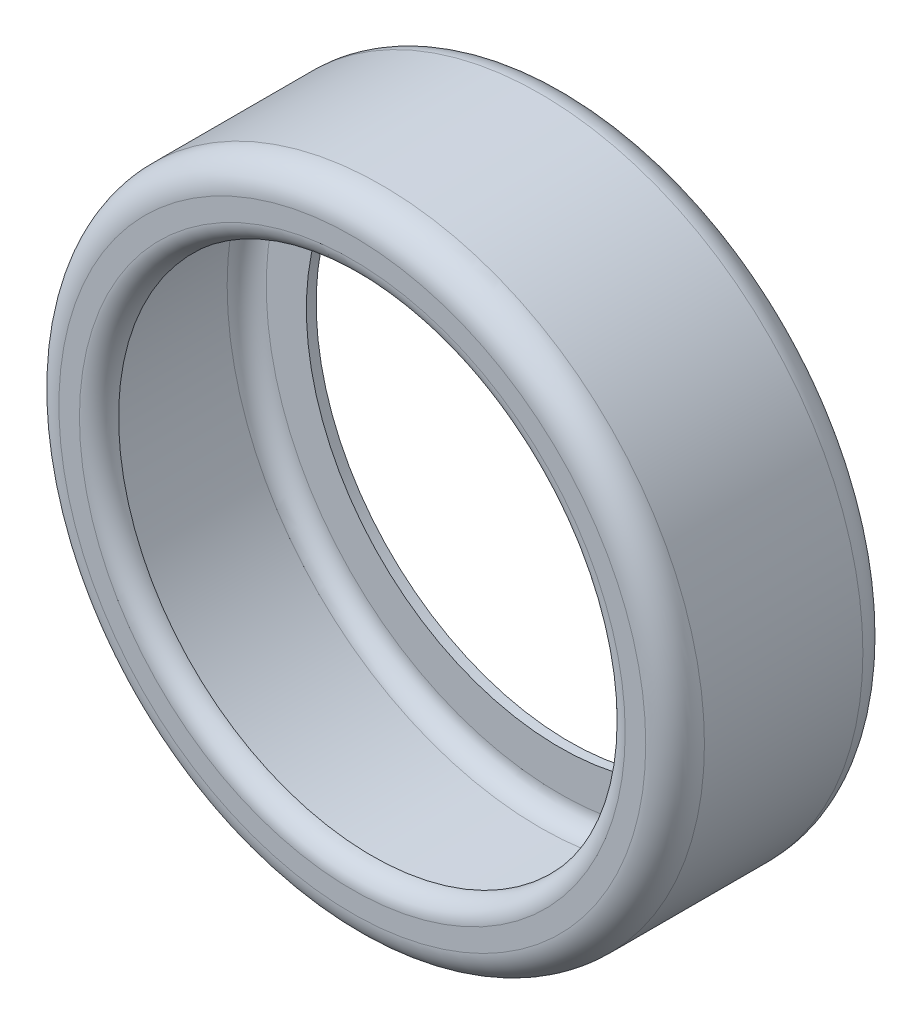
ISO-10303-21;
HEADER;
FILE_DESCRIPTION(('STEP AP214'),'2;1');
FILE_NAME('part.step','',(''),(''),'','','');
FILE_SCHEMA(('AUTOMOTIVE_DESIGN { 1 0 10303 214 1 1 1 1 }'));
ENDSEC;
DATA;
#1=APPLICATION_CONTEXT('core data for automotive mechanical design processes');
#2=APPLICATION_PROTOCOL_DEFINITION('international standard','automotive_design',2000,#1);
#3=PRODUCT_CONTEXT('',#1,'mechanical');
#4=PRODUCT('Part','Part','',(#3));
#5=PRODUCT_RELATED_PRODUCT_CATEGORY('part','',(#4));
#6=PRODUCT_DEFINITION_FORMATION('','',#4);
#7=PRODUCT_DEFINITION_CONTEXT('part definition',#1,'design');
#8=PRODUCT_DEFINITION('design','',#6,#7);
#9=PRODUCT_DEFINITION_SHAPE('','',#8);
#10=(LENGTH_UNIT() NAMED_UNIT(*) SI_UNIT(.MILLI.,.METRE.));
#11=(NAMED_UNIT(*) PLANE_ANGLE_UNIT() SI_UNIT($,.RADIAN.));
#12=(NAMED_UNIT(*) SI_UNIT($,.STERADIAN.) SOLID_ANGLE_UNIT());
#13=UNCERTAINTY_MEASURE_WITH_UNIT(LENGTH_MEASURE(1.E-05),#10,'distance_accuracy_value','');
#14=(GEOMETRIC_REPRESENTATION_CONTEXT(3) GLOBAL_UNCERTAINTY_ASSIGNED_CONTEXT((#13)) GLOBAL_UNIT_ASSIGNED_CONTEXT((#10,
#11,#12)) REPRESENTATION_CONTEXT('',''));
#15=CARTESIAN_POINT('',(0.,0.,0.));
#16=DIRECTION('',(0.,0.,1.));
#17=DIRECTION('',(1.,0.,0.));
#18=AXIS2_PLACEMENT_3D('',#15,#16,#17);
#19=CARTESIAN_POINT('',(0.,0.,222.));
#20=DIRECTION('',(0.,0.,-1.));
#21=DIRECTION('',(-1.,0.,0.));
#22=AXIS2_PLACEMENT_3D('',#19,#20,#21);
#23=CYLINDRICAL_SURFACE('',#22,259.);
#24=CARTESIAN_POINT('',(0.,0.,0.));
#25=DIRECTION('',(0.,0.,1.));
#26=DIRECTION('',(1.,0.,0.));
#27=AXIS2_PLACEMENT_3D('',#24,#25,#26);
#28=CIRCLE('',#27,259.);
#29=CARTESIAN_POINT('',(259.,0.,0.));
#30=VERTEX_POINT('',#29);
#31=EDGE_CURVE('E69',#30,#30,#28,.T.);
#32=ORIENTED_EDGE('',*,*,#31,.F.);
#33=EDGE_LOOP('',(#32));
#34=FACE_BOUND('',#33,.T.);
#35=CARTESIAN_POINT('',(0.,0.,10.));
#36=DIRECTION('',(0.,0.,1.));
#37=DIRECTION('',(1.,0.,0.));
#38=AXIS2_PLACEMENT_3D('',#35,#36,#37);
#39=CIRCLE('',#38,259.);
#40=CARTESIAN_POINT('',(259.,0.,10.));
#41=VERTEX_POINT('',#40);
#42=EDGE_CURVE('E78',#41,#41,#39,.T.);
#43=ORIENTED_EDGE('',*,*,#42,.T.);
#44=EDGE_LOOP('',(#43));
#45=FACE_BOUND('',#44,.T.);
#46=ADVANCED_FACE('F41',(#34,#45),#23,.F.);
#47=CARTESIAN_POINT('',(0.,0.,222.));
#48=DIRECTION('',(0.,0.,1.));
#49=DIRECTION('',(1.,0.,0.));
#50=AXIS2_PLACEMENT_3D('',#47,#48,#49);
#51=PLANE('',#50);
#52=CARTESIAN_POINT('',(0.,0.,222.));
#53=DIRECTION('',(0.,0.,1.));
#54=DIRECTION('',(1.,0.,0.));
#55=AXIS2_PLACEMENT_3D('',#52,#53,#54);
#56=CIRCLE('',#55,279.);
#57=CARTESIAN_POINT('',(279.,0.,222.));
#58=VERTEX_POINT('',#57);
#59=EDGE_CURVE('E10',#58,#58,#56,.F.);
#60=ORIENTED_EDGE('',*,*,#59,.T.);
#61=EDGE_LOOP('',(#60));
#62=FACE_BOUND('',#61,.T.);
#63=CARTESIAN_POINT('',(0.,0.,222.));
#64=DIRECTION('',(0.,0.,1.));
#65=DIRECTION('',(1.,0.,0.));
#66=AXIS2_PLACEMENT_3D('',#63,#64,#65);
#67=CIRCLE('',#66,300.);
#68=CARTESIAN_POINT('',(300.,0.,222.));
#69=VERTEX_POINT('',#68);
#70=EDGE_CURVE('E49',#69,#69,#67,.T.);
#71=ORIENTED_EDGE('',*,*,#70,.T.);
#72=EDGE_LOOP('',(#71));
#73=FACE_BOUND('',#72,.T.);
#74=ADVANCED_FACE('F121',(#62,#73),#51,.T.);
#75=CARTESIAN_POINT('',(0.,0.,0.));
#76=DIRECTION('',(0.,0.,1.));
#77=DIRECTION('',(1.,0.,0.));
#78=AXIS2_PLACEMENT_3D('',#75,#76,#77);
#79=PLANE('',#78);
#80=CARTESIAN_POINT('',(0.,0.,0.));
#81=DIRECTION('',(0.,0.,1.));
#82=DIRECTION('',(1.,0.,0.));
#83=AXIS2_PLACEMENT_3D('',#80,#81,#82);
#84=CIRCLE('',#83,300.);
#85=CARTESIAN_POINT('',(300.,0.,0.));
#86=VERTEX_POINT('',#85);
#87=EDGE_CURVE('E54',#86,#86,#84,.F.);
#88=ORIENTED_EDGE('',*,*,#87,.T.);
#89=EDGE_LOOP('',(#88));
#90=FACE_BOUND('',#89,.T.);
#91=ORIENTED_EDGE('',*,*,#31,.T.);
#92=EDGE_LOOP('',(#91));
#93=FACE_BOUND('',#92,.T.);
#94=ADVANCED_FACE('F127',(#90,#93),#79,.F.);
#95=CARTESIAN_POINT('',(0.,0.,222.));
#96=DIRECTION('',(0.,0.,-1.));
#97=DIRECTION('',(-1.,0.,0.));
#98=AXIS2_PLACEMENT_3D('',#95,#96,#97);
#99=CYLINDRICAL_SURFACE('',#98,330.);
#100=CARTESIAN_POINT('',(0.,0.,30.));
#101=DIRECTION('',(0.,0.,1.));
#102=DIRECTION('',(1.,0.,0.));
#103=AXIS2_PLACEMENT_3D('',#100,#101,#102);
#104=CIRCLE('',#103,330.);
#105=CARTESIAN_POINT('',(330.,0.,30.));
#106=VERTEX_POINT('',#105);
#107=EDGE_CURVE('E59',#106,#106,#104,.T.);
#108=ORIENTED_EDGE('',*,*,#107,.T.);
#109=EDGE_LOOP('',(#108));
#110=FACE_BOUND('',#109,.T.);
#111=CARTESIAN_POINT('',(0.,0.,192.));
#112=DIRECTION('',(0.,0.,1.));
#113=DIRECTION('',(1.,0.,0.));
#114=AXIS2_PLACEMENT_3D('',#111,#112,#113);
#115=CIRCLE('',#114,330.);
#116=CARTESIAN_POINT('',(330.,0.,192.));
#117=VERTEX_POINT('',#116);
#118=EDGE_CURVE('E65',#117,#117,#115,.F.);
#119=ORIENTED_EDGE('',*,*,#118,.T.);
#120=EDGE_LOOP('',(#119));
#121=FACE_BOUND('',#120,.T.);
#122=ADVANCED_FACE('F137',(#110,#121),#99,.T.);
#123=CARTESIAN_POINT('',(0.,0.,30.));
#124=DIRECTION('',(0.,0.,1.));
#125=DIRECTION('',(1.,0.,0.));
#126=AXIS2_PLACEMENT_3D('',#123,#124,#125);
#127=TOROIDAL_SURFACE('',#126,300.,30.);
#128=ORIENTED_EDGE('',*,*,#87,.F.);
#129=EDGE_LOOP('',(#128));
#130=FACE_BOUND('',#129,.T.);
#131=ORIENTED_EDGE('',*,*,#107,.F.);
#132=EDGE_LOOP('',(#131));
#133=FACE_BOUND('',#132,.T.);
#134=ADVANCED_FACE('F118',(#130,#133),#127,.T.);
#135=CARTESIAN_POINT('',(0.,0.,192.));
#136=DIRECTION('',(0.,0.,1.));
#137=DIRECTION('',(1.,0.,0.));
#138=AXIS2_PLACEMENT_3D('',#135,#136,#137);
#139=TOROIDAL_SURFACE('',#138,300.,30.);
#140=ORIENTED_EDGE('',*,*,#118,.F.);
#141=EDGE_LOOP('',(#140));
#142=FACE_BOUND('',#141,.T.);
#143=ORIENTED_EDGE('',*,*,#70,.F.);
#144=EDGE_LOOP('',(#143));
#145=FACE_BOUND('',#144,.T.);
#146=ADVANCED_FACE('F110',(#142,#145),#139,.T.);
#147=CARTESIAN_POINT('',(0.,0.,202.));
#148=DIRECTION('',(0.,0.,1.));
#149=DIRECTION('',(1.,0.,0.));
#150=AXIS2_PLACEMENT_3D('',#147,#148,#149);
#151=TOROIDAL_SURFACE('',#150,279.,20.);
#152=ORIENTED_EDGE('',*,*,#59,.F.);
#153=EDGE_LOOP('',(#152));
#154=FACE_BOUND('',#153,.T.);
#155=CARTESIAN_POINT('',(0.,0.,202.));
#156=DIRECTION('',(0.,0.,1.));
#157=DIRECTION('',(1.,0.,0.));
#158=AXIS2_PLACEMENT_3D('',#155,#156,#157);
#159=CIRCLE('',#158,259.);
#160=CARTESIAN_POINT('',(259.,0.,202.));
#161=VERTEX_POINT('',#160);
#162=EDGE_CURVE('E98',#161,#161,#159,.T.);
#163=ORIENTED_EDGE('',*,*,#162,.F.);
#164=EDGE_LOOP('',(#163));
#165=FACE_BOUND('',#164,.T.);
#166=ADVANCED_FACE('F43',(#154,#165),#151,.T.);
#167=CARTESIAN_POINT('',(0.,0.,202.));
#168=DIRECTION('',(0.,0.,-1.));
#169=DIRECTION('',(-1.,0.,0.));
#170=AXIS2_PLACEMENT_3D('',#167,#168,#169);
#171=PLANE('',#170);
#172=ORIENTED_EDGE('',*,*,#162,.T.);
#173=EDGE_LOOP('',(#172));
#174=FACE_BOUND('',#173,.T.);
#175=CARTESIAN_POINT('',(0.,0.,202.));
#176=DIRECTION('',(0.,0.,1.));
#177=DIRECTION('',(1.,0.,0.));
#178=AXIS2_PLACEMENT_3D('',#175,#176,#177);
#179=CIRCLE('',#178,269.);
#180=CARTESIAN_POINT('',(269.,0.,202.));
#181=VERTEX_POINT('',#180);
#182=EDGE_CURVE('E73',#181,#181,#179,.T.);
#183=ORIENTED_EDGE('',*,*,#182,.F.);
#184=EDGE_LOOP('',(#183));
#185=FACE_BOUND('',#184,.T.);
#186=ADVANCED_FACE('F106',(#174,#185),#171,.T.);
#187=CARTESIAN_POINT('',(0.,0.,212.));
#188=DIRECTION('',(0.,0.,1.));
#189=DIRECTION('',(1.,0.,0.));
#190=AXIS2_PLACEMENT_3D('',#187,#188,#189);
#191=PLANE('',#190);
#192=CARTESIAN_POINT('',(0.,0.,212.));
#193=DIRECTION('',(0.,0.,1.));
#194=DIRECTION('',(1.,0.,0.));
#195=AXIS2_PLACEMENT_3D('',#192,#193,#194);
#196=CIRCLE('',#195,279.);
#197=CARTESIAN_POINT('',(279.,0.,212.));
#198=VERTEX_POINT('',#197);
#199=EDGE_CURVE('E77',#198,#198,#196,.F.);
#200=ORIENTED_EDGE('',*,*,#199,.F.);
#201=EDGE_LOOP('',(#200));
#202=FACE_BOUND('',#201,.T.);
#203=CARTESIAN_POINT('',(0.,0.,212.));
#204=DIRECTION('',(0.,0.,1.));
#205=DIRECTION('',(1.,0.,0.));
#206=AXIS2_PLACEMENT_3D('',#203,#204,#205);
#207=CIRCLE('',#206,300.);
#208=CARTESIAN_POINT('',(300.,0.,212.));
#209=VERTEX_POINT('',#208);
#210=EDGE_CURVE('E87',#209,#209,#207,.T.);
#211=ORIENTED_EDGE('',*,*,#210,.F.);
#212=EDGE_LOOP('',(#211));
#213=FACE_BOUND('',#212,.T.);
#214=ADVANCED_FACE('F116',(#202,#213),#191,.F.);
#215=CARTESIAN_POINT('',(0.,0.,10.));
#216=DIRECTION('',(0.,0.,1.));
#217=DIRECTION('',(1.,0.,0.));
#218=AXIS2_PLACEMENT_3D('',#215,#216,#217);
#219=PLANE('',#218);
#220=CARTESIAN_POINT('',(0.,0.,10.));
#221=DIRECTION('',(0.,0.,1.));
#222=DIRECTION('',(1.,0.,0.));
#223=AXIS2_PLACEMENT_3D('',#220,#221,#222);
#224=CIRCLE('',#223,300.);
#225=CARTESIAN_POINT('',(300.,0.,10.));
#226=VERTEX_POINT('',#225);
#227=EDGE_CURVE('E83',#226,#226,#224,.F.);
#228=ORIENTED_EDGE('',*,*,#227,.F.);
#229=EDGE_LOOP('',(#228));
#230=FACE_BOUND('',#229,.T.);
#231=ORIENTED_EDGE('',*,*,#42,.F.);
#232=EDGE_LOOP('',(#231));
#233=FACE_BOUND('',#232,.T.);
#234=ADVANCED_FACE('F195',(#230,#233),#219,.T.);
#235=CARTESIAN_POINT('',(0.,0.,222.));
#236=DIRECTION('',(0.,0.,-1.));
#237=DIRECTION('',(-1.,0.,0.));
#238=AXIS2_PLACEMENT_3D('',#235,#236,#237);
#239=CYLINDRICAL_SURFACE('',#238,320.);
#240=CARTESIAN_POINT('',(0.,0.,30.));
#241=DIRECTION('',(0.,0.,-1.));
#242=DIRECTION('',(-1.,0.,0.));
#243=AXIS2_PLACEMENT_3D('',#240,#241,#242);
#244=CIRCLE('',#243,320.);
#245=CARTESIAN_POINT('',(-320.,0.,30.));
#246=VERTEX_POINT('',#245);
#247=EDGE_CURVE('E88',#246,#246,#244,.F.);
#248=ORIENTED_EDGE('',*,*,#247,.F.);
#249=EDGE_LOOP('',(#248));
#250=FACE_BOUND('',#249,.T.);
#251=CARTESIAN_POINT('',(0.,0.,192.));
#252=DIRECTION('',(0.,0.,-1.));
#253=DIRECTION('',(-1.,0.,0.));
#254=AXIS2_PLACEMENT_3D('',#251,#252,#253);
#255=CIRCLE('',#254,320.);
#256=CARTESIAN_POINT('',(-320.,0.,192.));
#257=VERTEX_POINT('',#256);
#258=EDGE_CURVE('E82',#257,#257,#255,.T.);
#259=ORIENTED_EDGE('',*,*,#258,.F.);
#260=EDGE_LOOP('',(#259));
#261=FACE_BOUND('',#260,.T.);
#262=ADVANCED_FACE('F205',(#250,#261),#239,.F.);
#263=CARTESIAN_POINT('',(0.,0.,30.));
#264=DIRECTION('',(0.,0.,1.));
#265=DIRECTION('',(1.,0.,0.));
#266=AXIS2_PLACEMENT_3D('',#263,#264,#265);
#267=TOROIDAL_SURFACE('',#266,300.,20.);
#268=ORIENTED_EDGE('',*,*,#227,.T.);
#269=EDGE_LOOP('',(#268));
#270=FACE_BOUND('',#269,.T.);
#271=ORIENTED_EDGE('',*,*,#247,.T.);
#272=EDGE_LOOP('',(#271));
#273=FACE_BOUND('',#272,.T.);
#274=ADVANCED_FACE('F216',(#270,#273),#267,.F.);
#275=CARTESIAN_POINT('',(0.,0.,192.));
#276=DIRECTION('',(0.,0.,1.));
#277=DIRECTION('',(1.,0.,0.));
#278=AXIS2_PLACEMENT_3D('',#275,#276,#277);
#279=TOROIDAL_SURFACE('',#278,300.,20.);
#280=ORIENTED_EDGE('',*,*,#258,.T.);
#281=EDGE_LOOP('',(#280));
#282=FACE_BOUND('',#281,.T.);
#283=ORIENTED_EDGE('',*,*,#210,.T.);
#284=EDGE_LOOP('',(#283));
#285=FACE_BOUND('',#284,.T.);
#286=ADVANCED_FACE('F227',(#282,#285),#279,.F.);
#287=CARTESIAN_POINT('',(0.,0.,202.));
#288=DIRECTION('',(0.,0.,1.));
#289=DIRECTION('',(1.,0.,0.));
#290=AXIS2_PLACEMENT_3D('',#287,#288,#289);
#291=TOROIDAL_SURFACE('',#290,279.,10.);
#292=ORIENTED_EDGE('',*,*,#199,.T.);
#293=EDGE_LOOP('',(#292));
#294=FACE_BOUND('',#293,.T.);
#295=ORIENTED_EDGE('',*,*,#182,.T.);
#296=EDGE_LOOP('',(#295));
#297=FACE_BOUND('',#296,.T.);
#298=ADVANCED_FACE('F132',(#294,#297),#291,.F.);
#299=CLOSED_SHELL('',(#46,#74,#94,#122,#134,#146,#166,#186,#214,#234,#262,#274,#286,#298));
#300=MANIFOLD_SOLID_BREP('B2',#299);
#301=ADVANCED_BREP_SHAPE_REPRESENTATION('',(#18,#300),#14);
#302=SHAPE_DEFINITION_REPRESENTATION(#9,#301);
ENDSEC;
END-ISO-10303-21;
